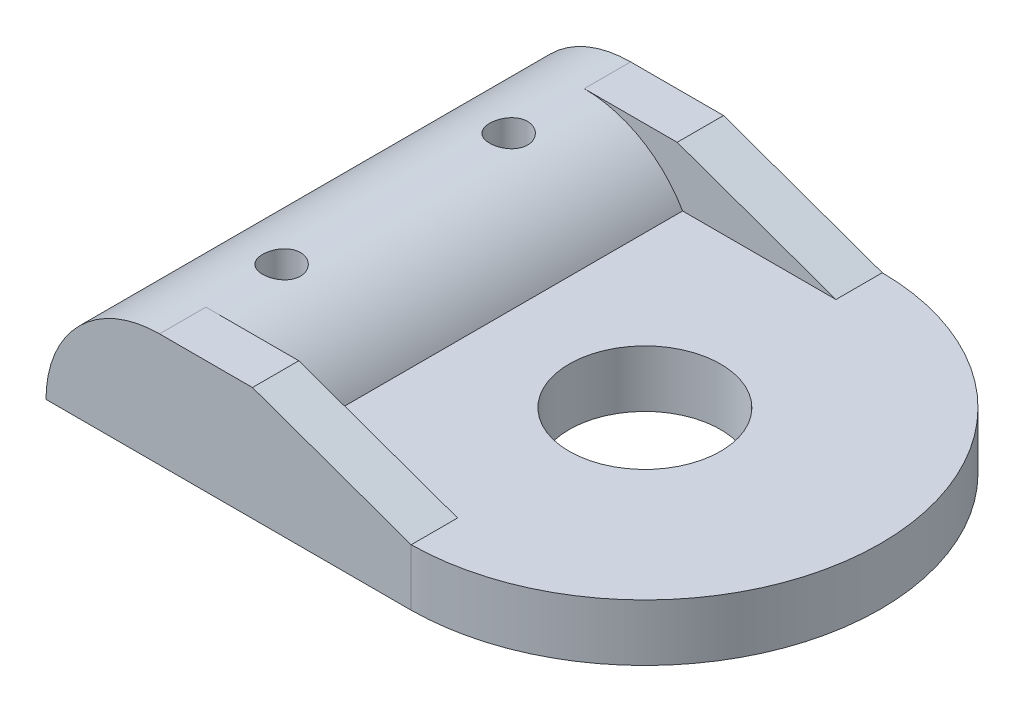
ISO-10303-21;
HEADER;
FILE_DESCRIPTION(('STEP AP214'),'2;1');
FILE_NAME('part.step','',(''),(''),'','','');
FILE_SCHEMA(('AUTOMOTIVE_DESIGN { 1 0 10303 214 1 1 1 1 }'));
ENDSEC;
DATA;
#1=APPLICATION_CONTEXT('core data for automotive mechanical design processes');
#2=APPLICATION_PROTOCOL_DEFINITION('international standard','automotive_design',2000,#1);
#3=PRODUCT_CONTEXT('',#1,'mechanical');
#4=PRODUCT('Part','Part','',(#3));
#5=PRODUCT_RELATED_PRODUCT_CATEGORY('part','',(#4));
#6=PRODUCT_DEFINITION_FORMATION('','',#4);
#7=PRODUCT_DEFINITION_CONTEXT('part definition',#1,'design');
#8=PRODUCT_DEFINITION('design','',#6,#7);
#9=PRODUCT_DEFINITION_SHAPE('','',#8);
#10=(LENGTH_UNIT() NAMED_UNIT(*) SI_UNIT(.MILLI.,.METRE.));
#11=(NAMED_UNIT(*) PLANE_ANGLE_UNIT() SI_UNIT($,.RADIAN.));
#12=(NAMED_UNIT(*) SI_UNIT($,.STERADIAN.) SOLID_ANGLE_UNIT());
#13=UNCERTAINTY_MEASURE_WITH_UNIT(LENGTH_MEASURE(1.E-05),#10,'distance_accuracy_value','');
#14=(GEOMETRIC_REPRESENTATION_CONTEXT(3) GLOBAL_UNCERTAINTY_ASSIGNED_CONTEXT((#13)) GLOBAL_UNIT_ASSIGNED_CONTEXT((#10,
#11,#12)) REPRESENTATION_CONTEXT('',''));
#15=CARTESIAN_POINT('',(0.,0.,0.));
#16=DIRECTION('',(0.,0.,1.));
#17=DIRECTION('',(1.,0.,0.));
#18=AXIS2_PLACEMENT_3D('',#15,#16,#17);
#19=CARTESIAN_POINT('',(4.11917536426009,3.,0.372218896237082));
#20=DIRECTION('',(0.,1.,0.));
#21=DIRECTION('',(0.,0.,1.));
#22=AXIS2_PLACEMENT_3D('',#19,#20,#21);
#23=PLANE('',#22);
#24=CARTESIAN_POINT('',(4.11917536426009,3.,0.372218896237082));
#25=DIRECTION('',(0.,1.,0.));
#26=DIRECTION('',(0.,0.,1.));
#27=AXIS2_PLACEMENT_3D('',#24,#25,#26);
#28=CIRCLE('',#27,3.99942615782216);
#29=CARTESIAN_POINT('',(4.11917536426009,3.,4.37164505405924));
#30=VERTEX_POINT('',#29);
#31=EDGE_CURVE('E165',#30,#30,#28,.T.);
#32=ORIENTED_EDGE('',*,*,#31,.F.);
#33=EDGE_LOOP('',(#32));
#34=FACE_BOUND('',#33,.T.);
#35=DIRECTION('',(0.,0.,-1.));
#36=VECTOR('',#35,1.);
#37=CARTESIAN_POINT('',(4.21842255479832,3.,-12.0752609670835));
#38=LINE('',#37,#36);
#39=CARTESIAN_POINT('',(4.21842255479832,3.,-9.62526096708351));
#40=VERTEX_POINT('',#39);
#41=CARTESIAN_POINT('',(4.21842255479832,3.,-12.0752609670835));
#42=VERTEX_POINT('',#41);
#43=EDGE_CURVE('E210',#40,#42,#38,.T.);
#44=ORIENTED_EDGE('',*,*,#43,.F.);
#45=DIRECTION('',(1.,0.,0.));
#46=VECTOR('',#45,1.);
#47=CARTESIAN_POINT('',(4.21842255479832,3.,-9.62526096708351));
#48=LINE('',#47,#46);
#49=CARTESIAN_POINT('',(-3.88542473638954,3.,-9.62526096708351));
#50=VERTEX_POINT('',#49);
#51=EDGE_CURVE('E209',#50,#40,#48,.T.);
#52=ORIENTED_EDGE('',*,*,#51,.F.);
#53=DIRECTION('',(0.,0.,1.));
#54=VECTOR('',#53,1.);
#55=CARTESIAN_POINT('',(-3.88542473638954,3.,-22.8919147934755));
#56=LINE('',#55,#54);
#57=CARTESIAN_POINT('',(-3.88542473638954,3.,10.3696987595577));
#58=VERTEX_POINT('',#57);
#59=EDGE_CURVE('E137',#50,#58,#56,.T.);
#60=ORIENTED_EDGE('',*,*,#59,.T.);
#61=DIRECTION('',(-1.,0.,0.));
#62=VECTOR('',#61,1.);
#63=CARTESIAN_POINT('',(4.21842255479832,3.,10.3696987595577));
#64=LINE('',#63,#62);
#65=CARTESIAN_POINT('',(4.21842255479832,3.,10.3696987595577));
#66=VERTEX_POINT('',#65);
#67=EDGE_CURVE('E146',#66,#58,#64,.T.);
#68=ORIENTED_EDGE('',*,*,#67,.F.);
#69=DIRECTION('',(0.,0.,-1.));
#70=VECTOR('',#69,1.);
#71=CARTESIAN_POINT('',(4.21842255479832,3.,12.8196987595577));
#72=LINE('',#71,#70);
#73=CARTESIAN_POINT('',(4.21842255479832,3.,12.8196987595577));
#74=VERTEX_POINT('',#73);
#75=EDGE_CURVE('E143',#74,#66,#72,.T.);
#76=ORIENTED_EDGE('',*,*,#75,.F.);
#77=CARTESIAN_POINT('',(4.11917536426009,3.,0.372218896237082));
#78=DIRECTION('',(0.,1.,0.));
#79=DIRECTION('',(0.,0.,1.));
#80=AXIS2_PLACEMENT_3D('',#77,#78,#79);
#81=CIRCLE('',#80,12.447875519646);
#82=EDGE_CURVE('E173',#74,#42,#81,.T.);
#83=ORIENTED_EDGE('',*,*,#82,.T.);
#84=EDGE_LOOP('',(#44,#52,#60,#68,#76,#83));
#85=FACE_BOUND('',#84,.T.);
#86=ADVANCED_FACE('F39',(#34,#85),#23,.T.);
#87=CARTESIAN_POINT('',(-9.08157715909618,0.,-22.8919147934755));
#88=DIRECTION('',(0.,0.,1.));
#89=DIRECTION('',(1.,0.,0.));
#90=AXIS2_PLACEMENT_3D('',#87,#88,#89);
#91=CYLINDRICAL_SURFACE('',#90,6.);
#92=CARTESIAN_POINT('',(-9.08157736726677,6.,-6.62840351469082));
#93=CARTESIAN_POINT('',(-9.13733373608122,5.9999990427406,-6.62840127911144));
#94=CARTESIAN_POINT('',(-9.19312053363991,5.9992147075897,-6.62372460412152));
#95=CARTESIAN_POINT('',(-9.30312948293314,5.99616137113838,-6.60514924832354));
#96=CARTESIAN_POINT('',(-9.35735014800049,5.99389100463113,-6.59124208736609));
#97=CARTESIAN_POINT('',(-9.4626193123622,5.98812025681556,-6.55463732626242));
#98=CARTESIAN_POINT('',(-9.5136703669585,5.98462088187845,-6.53194691671398));
#99=CARTESIAN_POINT('',(-9.6112341680315,5.97677688426047,-6.47843857974568));
#100=CARTESIAN_POINT('',(-9.6577474327377,5.97243235826851,-6.44762158189909));
#101=CARTESIAN_POINT('',(-9.74536649314108,5.96333323778109,-6.3784214509825));
#102=CARTESIAN_POINT('',(-9.78642261390057,5.95857545258506,-6.3399758339112));
#103=CARTESIAN_POINT('',(-9.8615328612073,5.94921046786042,-6.25674428206739));
#104=CARTESIAN_POINT('',(-9.89558654569421,5.94460327785425,-6.21195794730969));
#105=CARTESIAN_POINT('',(-9.95592432358438,5.93603021677279,-6.11697506558181));
#106=CARTESIAN_POINT('',(-9.98215929769411,5.93206846818264,-6.06674691106923));
#107=CARTESIAN_POINT('',(-10.0258008280066,5.92527910775825,-5.96251960701163));
#108=CARTESIAN_POINT('',(-10.043207980554,5.9224514193177,-5.90852071247131));
#109=CARTESIAN_POINT('',(-10.0685432378852,5.91828209272935,-5.79881130260128));
#110=CARTESIAN_POINT('',(-10.0765570992656,5.91692701870042,-5.74312111135401));
#111=CARTESIAN_POINT('',(-10.0831441783145,5.91581570002871,-5.6311712819635));
#112=CARTESIAN_POINT('',(-10.0817180641015,5.91605934223605,-5.57491168440165));
#113=CARTESIAN_POINT('',(-10.0695355257645,5.91810566081447,-5.46403222883277));
#114=CARTESIAN_POINT('',(-10.0588754379436,5.91989223944691,-5.4094014458394));
#115=CARTESIAN_POINT('',(-10.0286787380208,5.92479792925377,-5.30271482825528));
#116=CARTESIAN_POINT('',(-10.0091418214774,5.92791708613035,-5.25065908204645));
#117=CARTESIAN_POINT('',(-9.96164837307206,5.93515387055943,-5.15031180891748));
#118=CARTESIAN_POINT('',(-9.93365183715376,5.93927622361583,-5.10203957035188));
#119=CARTESIAN_POINT('',(-9.87006227177794,5.94805163316118,-5.01084156211466));
#120=CARTESIAN_POINT('',(-9.83446862920198,5.95270473246946,-4.96791622440345));
#121=CARTESIAN_POINT('',(-9.75617033709956,5.96208807838317,-4.88807287343402));
#122=CARTESIAN_POINT('',(-9.71338303283066,5.96681856645433,-4.85123589572029));
#123=CARTESIAN_POINT('',(-9.62219153625131,5.97577038051896,-4.78525218971124));
#124=CARTESIAN_POINT('',(-9.5737873077528,5.97999170323169,-4.75610551096604));
#125=CARTESIAN_POINT('',(-9.47265978530612,5.98745555465989,-4.70632239358313));
#126=CARTESIAN_POINT('',(-9.41993290256392,5.99069725938861,-4.68569311387927));
#127=CARTESIAN_POINT('',(-9.3116967371205,5.99583000290953,-4.65360559102985));
#128=CARTESIAN_POINT('',(-9.25618768759404,5.99772115469032,-4.64214658068079));
#129=CARTESIAN_POINT('',(-9.14466133857459,5.9999245171317,-4.62883473005876));
#130=CARTESIAN_POINT('',(-9.08865766601041,6.00025501186507,-4.62687064430186));
#131=CARTESIAN_POINT('',(-8.97712144816774,5.99934990120014,-4.63230781115083));
#132=CARTESIAN_POINT('',(-8.92158888484448,5.99811435606057,-4.63970870340726));
#133=CARTESIAN_POINT('',(-8.81291486694258,5.99422731579138,-4.66357321653672));
#134=CARTESIAN_POINT('',(-8.75976098347501,5.99158442848139,-4.67998176196736));
#135=CARTESIAN_POINT('',(-8.65695856459338,5.98517786918527,-4.72133709051649));
#136=CARTESIAN_POINT('',(-8.60731022621415,5.98141413426203,-4.74628435310729));
#137=CARTESIAN_POINT('',(-8.5124450254786,5.97313807880032,-4.80426374244933));
#138=CARTESIAN_POINT('',(-8.46727119553224,5.96861943766409,-4.83736535872793));
#139=CARTESIAN_POINT('',(-8.3830798516592,5.95935388446091,-4.91061823059262));
#140=CARTESIAN_POINT('',(-8.34406278529402,5.95460695583146,-4.95076999823655));
#141=CARTESIAN_POINT('',(-8.27288016058081,5.94536071638776,-5.03748233796851));
#142=CARTESIAN_POINT('',(-8.24078976398503,5.9408644800387,-5.08410499029549));
#143=CARTESIAN_POINT('',(-8.18489633722473,5.9326861345821,-5.18214452301921));
#144=CARTESIAN_POINT('',(-8.16109304436066,5.92900399966905,-5.23356125137917));
#145=CARTESIAN_POINT('',(-8.1225619204819,5.92289383001558,-5.33951924686048));
#146=CARTESIAN_POINT('',(-8.10779667795918,5.92046063235937,-5.39404659828208));
#147=CARTESIAN_POINT('',(-8.08764306641452,5.91711088226498,-5.50485142528434));
#148=CARTESIAN_POINT('',(-8.08225388218765,5.91619419797332,-5.56112874827995));
#149=CARTESIAN_POINT('',(-8.08102809979169,5.91598694706944,-5.67308546044099));
#150=CARTESIAN_POINT('',(-8.08507319196799,5.91667624073078,-5.72876355236291));
#151=CARTESIAN_POINT('',(-8.10234531241231,5.91955914052197,-5.83863511377483));
#152=CARTESIAN_POINT('',(-8.11557231091962,5.92175274177599,-5.89282858807622));
#153=CARTESIAN_POINT('',(-8.15078745738631,5.92738943991369,-5.99814680936672));
#154=CARTESIAN_POINT('',(-8.1727654194716,5.93083108369689,-6.04927504487816));
#155=CARTESIAN_POINT('',(-8.22484646017482,5.9385774905101,-6.14713772084181));
#156=CARTESIAN_POINT('',(-8.25494994178369,5.94288229634654,-6.19387194321477));
#157=CARTESIAN_POINT('',(-8.32284971957088,5.95193383076611,-6.28221770343301));
#158=CARTESIAN_POINT('',(-8.36073305237636,5.95668519670549,-6.32376188209327));
#159=CARTESIAN_POINT('',(-8.44293367508654,5.96605750323686,-6.39994412682161));
#160=CARTESIAN_POINT('',(-8.4872524478043,5.9706784134762,-6.43458059688215));
#161=CARTESIAN_POINT('',(-8.58142963633742,5.97930613074916,-6.49618280445517));
#162=CARTESIAN_POINT('',(-8.63132419506096,5.98330847642638,-6.52309391627335));
#163=CARTESIAN_POINT('',(-8.73497209455947,5.99020467990322,-6.56811130010541));
#164=CARTESIAN_POINT('',(-8.78872153073509,5.99309964105489,-6.58622634103439));
#165=CARTESIAN_POINT('',(-8.88249601638448,5.99682316938469,-6.60920562147432));
#166=CARTESIAN_POINT('',(-8.92195381361409,5.99800811409579,-6.6163933007455));
#167=CARTESIAN_POINT('',(-9.00146163234133,5.99959686661552,-6.62599300947068));
#168=CARTESIAN_POINT('',(-9.04151164363081,6.00000068787281,-6.62840512114596));
#169=CARTESIAN_POINT('',(-9.08157736726677,6.,-6.62840351469082));
#170=B_SPLINE_CURVE_WITH_KNOTS('',3,(#92,#93,#94,#95,#96,#97,#98,#99,#100,#101,#102,#103,#104,
#105,#106,#107,#108,#109,#110,#111,#112,#113,#114,#115,#116,#117,#118,#119,#120,#121,#122,#123,
#124,#125,#126,#127,#128,#129,#130,#131,#132,#133,#134,#135,#136,#137,#138,#139,#140,#141,#142,
#143,#144,#145,#146,#147,#148,#149,#150,#151,#152,#153,#154,#155,#156,#157,#158,#159,#160,#161,
#162,#163,#164,#165,#166,#167,#168,#169),.UNSPECIFIED.,.T.,.F.,(4,2,2,2,2,2,2,2,2,2,2,2,2,2,2,2,
2,2,2,2,2,2,2,2,2,2,2,2,2,2,2,2,2,2,2,2,2,2,4),(0.,0.167122654448334,0.334399059242411,
0.501538808208842,0.668659446905194,0.837210067389465,1.00577132512634,1.17537022910613,
1.34495767466871,1.51298449543574,1.68099942415514,1.84728231251463,2.01357090417887,
2.18065848977293,2.34775956513982,2.51693138287494,2.68610429059076,2.8554191012779,
3.02471974525996,3.1920319218123,3.35933766065431,3.52563165599521,3.691934990731,3.85970776917,
4.02749273811751,4.1970157938139,4.36653347517349,4.53534463549733,4.70414111773744,
4.87083222520226,5.03752279238489,5.20401990100976,5.37052526869543,5.53900620579525,
5.70752602498027,5.8772096359117,6.04672373800653,6.16681773830443,6.28690967091786),.UNSPECIFIED.);
#171=CARTESIAN_POINT('',(-9.08157736726677,6.,-6.62840351469082));
#172=VERTEX_POINT('',#171);
#173=EDGE_CURVE('E248',#172,#172,#170,.T.);
#174=ORIENTED_EDGE('',*,*,#173,.F.);
#175=EDGE_LOOP('',(#174));
#176=FACE_BOUND('',#175,.T.);
#177=CARTESIAN_POINT('',(-9.08157658468094,5.99999999999997,5.3715961947882));
#178=CARTESIAN_POINT('',(-9.13733297233239,5.99999905001255,5.37159843036785));
#179=CARTESIAN_POINT('',(-9.19311978882885,5.99921472160821,5.37627510685072));
#180=CARTESIAN_POINT('',(-9.30312877565598,5.99616139744235,5.39485046866601));
#181=CARTESIAN_POINT('',(-9.35734945931987,5.99389103647353,5.40875763414646));
#182=CARTESIAN_POINT('',(-9.46261865997638,5.98812029848601,5.44536240724483));
#183=CARTESIAN_POINT('',(-9.51366973227048,5.98462092783906,5.46805282426587));
#184=CARTESIAN_POINT('',(-9.61123356730954,5.97677693763232,5.5215611789201));
#185=CARTESIAN_POINT('',(-9.65774684828365,5.97243241476147,5.55237818698059));
#186=CARTESIAN_POINT('',(-9.74536593936962,5.96333329953383,5.62157834077953));
#187=CARTESIAN_POINT('',(-9.78642207454079,5.95857551646859,5.66002397052358));
#188=CARTESIAN_POINT('',(-9.86153234841903,5.94921053517089,5.74325554979039));
#189=CARTESIAN_POINT('',(-9.89558604506536,5.94460334646082,5.78804189929871));
#190=CARTESIAN_POINT('',(-9.95592384518079,5.93603028729647,5.88302481288563));
#191=CARTESIAN_POINT('',(-9.98215882924281,5.93206853933167,5.93325298458005));
#192=CARTESIAN_POINT('',(-10.0258003764688,5.92527917974416,6.0374803243586));
#193=CARTESIAN_POINT('',(-10.0432075359767,5.92245149151527,6.09147923743829));
#194=CARTESIAN_POINT('',(-10.068542804206,5.91828216506399,6.20118868586709));
#195=CARTESIAN_POINT('',(-10.0765566694207,5.91692709098351,6.25687889715708));
#196=CARTESIAN_POINT('',(-10.0831437526753,5.91581577209203,6.36882876698738));
#197=CARTESIAN_POINT('',(-10.0817176388336,5.91605941413123,6.4250883849463));
#198=CARTESIAN_POINT('',(-10.0695350977381,5.91810573226979,6.53596788121998));
#199=CARTESIAN_POINT('',(-10.0588750067668,5.91989231064104,6.59059868451695));
#200=CARTESIAN_POINT('',(-10.0286782971003,5.92479799974873,6.6972853419014));
#201=CARTESIAN_POINT('',(-10.0091413739633,5.92791715618732,6.74934110760693));
#202=CARTESIAN_POINT('',(-9.96164790913384,5.935153939385,6.84968841828107));
#203=CARTESIAN_POINT('',(-9.93365136339652,5.9392762916431,6.89796067490171));
#204=CARTESIAN_POINT('',(-9.8700617753863,5.94805169902327,6.98915871735049));
#205=CARTESIAN_POINT('',(-9.83446811999507,5.95270479696459,7.03208407121831));
#206=CARTESIAN_POINT('',(-9.75616979987444,5.96208813925867,7.1119274518468));
#207=CARTESIAN_POINT('',(-9.71338248044372,5.9668186250668,7.14876444310565));
#208=CARTESIAN_POINT('',(-9.62219095142212,5.9757704335485,7.21474817345299));
#209=CARTESIAN_POINT('',(-9.57378670564376,5.97999175294135,7.24389486299215));
#210=CARTESIAN_POINT('',(-9.47265914775692,5.9874555964468,7.29367799852123));
#211=CARTESIAN_POINT('',(-9.41993224691304,5.99069729658537,7.31430728569429));
#212=CARTESIAN_POINT('',(-9.31169604437744,5.99583002966188,7.3463948204096));
#213=CARTESIAN_POINT('',(-9.25618697586068,5.99772117558859,7.35785383515606));
#214=CARTESIAN_POINT('',(-9.14466058903947,5.9999245251837,7.37116569136986));
#215=CARTESIAN_POINT('',(-9.08865689767237,6.00025501294583,7.37312977839949));
#216=CARTESIAN_POINT('',(-8.97712064246112,5.99934988734611,7.36769261117558));
#217=CARTESIAN_POINT('',(-8.92158806057223,5.99811433424288,7.36029171727086));
#218=CARTESIAN_POINT('',(-8.8129140055784,5.99422727735807,7.33642719792459));
#219=CARTESIAN_POINT('',(-8.75976010360858,5.99158438138093,7.32001864781743));
#220=CARTESIAN_POINT('',(-8.65695764884541,5.98517780437647,7.27866330712663));
#221=CARTESIAN_POINT('',(-8.60730929308741,5.98141406041188,7.25371603706939));
#222=CARTESIAN_POINT('',(-8.51244405785902,5.97313798675231,7.19573662949714));
#223=CARTESIAN_POINT('',(-8.46727021091906,5.96861933644426,7.16263500225809));
#224=CARTESIAN_POINT('',(-8.38307883513181,5.95935376543327,7.08938210575698));
#225=CARTESIAN_POINT('',(-8.34406175384668,5.95460682816785,7.04923032443629));
#226=CARTESIAN_POINT('',(-8.27287910133201,5.94536057239852,6.96251795443819));
#227=CARTESIAN_POINT('',(-8.24078869193604,5.94086432837319,6.91589528545045));
#228=CARTESIAN_POINT('',(-8.18489524261753,5.9326859691985,6.81785571724448));
#229=CARTESIAN_POINT('',(-8.16109193999431,5.92900382824347,6.76643897006368));
#230=CARTESIAN_POINT('',(-8.12256080044201,5.92289364868983,6.66048093643553));
#231=CARTESIAN_POINT('',(-8.10779555181642,5.92046044714262,6.60595356575945));
#232=CARTESIAN_POINT('',(-8.08764193140258,5.91711069161835,6.49514869937098));
#233=CARTESIAN_POINT('',(-8.08225274440723,5.9161940057873,6.43887135624408));
#234=CARTESIAN_POINT('',(-8.08102695996288,5.91598675429428,6.32691460545372));
#235=CARTESIAN_POINT('',(-8.08507205255502,5.91667604883061,6.27123649503886));
#236=CARTESIAN_POINT('',(-8.10234417664117,5.91955895264215,6.16136489701214));
#237=CARTESIAN_POINT('',(-8.11557117837423,5.92175255704151,6.10717140458882));
#238=CARTESIAN_POINT('',(-8.15078633388022,5.9273892635023,6.00185314810113));
#239=CARTESIAN_POINT('',(-8.17276430174747,5.93083091245682,5.95072489550367));
#240=CARTESIAN_POINT('',(-8.22484535638746,5.93857733130613,5.85286218654973));
#241=CARTESIAN_POINT('',(-8.25494884615241,5.94288214400753,5.80612794827319));
#242=CARTESIAN_POINT('',(-8.32284864337415,5.95193369364123,5.71778215640254));
#243=CARTESIAN_POINT('',(-8.36073198767004,5.95668506795499,5.67623796215472));
#244=CARTESIAN_POINT('',(-8.44293263568055,5.96605739206632,5.60005568830989));
#245=CARTESIAN_POINT('',(-8.48725142220949,5.97067831151141,5.56541920472168));
#246=CARTESIAN_POINT('',(-8.58142864170395,5.97930604768563,5.503816971585));
#247=CARTESIAN_POINT('',(-8.63132321772286,5.9833084030444,5.47690584794486));
#248=CARTESIAN_POINT('',(-8.73497115376281,5.99020462562986,5.43188844360965));
#249=CARTESIAN_POINT('',(-8.78872060918349,5.99309959620856,5.41377339399841));
#250=CARTESIAN_POINT('',(-8.88249513390895,5.99682314021435,5.39079410048573));
#251=CARTESIAN_POINT('',(-8.92195295075522,5.99800809126548,5.38360641655376));
#252=CARTESIAN_POINT('',(-9.00146080929883,5.99959685575764,5.37400670158794));
#253=CARTESIAN_POINT('',(-9.04151084078799,6.00000068264737,5.37159458833259));
#254=CARTESIAN_POINT('',(-9.08157658468094,5.99999999999997,5.3715961947882));
#255=B_SPLINE_CURVE_WITH_KNOTS('',3,(#177,#178,#179,#180,#181,#182,#183,#184,#185,#186,#187,
#188,#189,#190,#191,#192,#193,#194,#195,#196,#197,#198,#199,#200,#201,#202,#203,#204,#205,#206,
#207,#208,#209,#210,#211,#212,#213,#214,#215,#216,#217,#218,#219,#220,#221,#222,#223,#224,#225,
#226,#227,#228,#229,#230,#231,#232,#233,#234,#235,#236,#237,#238,#239,#240,#241,#242,#243,#244,
#245,#246,#247,#248,#249,#250,#251,#252,#253,#254),.UNSPECIFIED.,.T.,.F.,(4,2,2,2,2,2,2,2,2,2,2,
2,2,2,2,2,2,2,2,2,2,2,2,2,2,2,2,2,2,2,2,2,2,2,2,2,2,2,4),(0.,0.167122710888112,
0.334399172098372,0.50153897749787,0.6686596726389,0.837210349672201,1.00577166396795,
1.17537062691716,1.34495813146067,1.51298501308043,1.68100000265569,1.84728295225882,
2.01357160516857,2.18065925175656,2.34776038811393,2.51693226575142,2.68610523335264,
2.85542010160611,3.02472080314166,3.19203303582203,3.35933883080317,3.52563288424209,
3.69193627710146,3.85970911783555,4.02749414909651,4.19701726903559,4.36653501461495,
4.53534623559454,4.70414277845152,4.87083394109635,5.03752456345449,5.20402172664908,
5.37052714893028,5.53900814547336,5.70752802413462,5.87721169915303,6.04672586531099,
6.16681992631668,6.28691191963228),.UNSPECIFIED.);
#256=CARTESIAN_POINT('',(-9.08157658468094,5.99999999999997,5.3715961947882));
#257=VERTEX_POINT('',#256);
#258=EDGE_CURVE('E127',#257,#257,#255,.T.);
#259=ORIENTED_EDGE('',*,*,#258,.F.);
#260=EDGE_LOOP('',(#259));
#261=FACE_BOUND('',#260,.T.);
#262=DIRECTION('',(0.,0.,1.));
#263=VECTOR('',#262,1.);
#264=CARTESIAN_POINT('',(-9.08157715909618,6.,-12.0752609670835));
#265=LINE('',#264,#263);
#266=CARTESIAN_POINT('',(-9.08157715909618,6.,-12.0752609670835));
#267=VERTEX_POINT('',#266);
#268=CARTESIAN_POINT('',(-9.08157715909618,6.,-9.62526096708351));
#269=VERTEX_POINT('',#268);
#270=EDGE_CURVE('E219',#267,#269,#265,.T.);
#271=ORIENTED_EDGE('',*,*,#270,.F.);
#272=CARTESIAN_POINT('',(-9.08157715909618,0.,-12.0752609670835));
#273=DIRECTION('',(0.,0.,1.));
#274=DIRECTION('',(1.,0.,0.));
#275=AXIS2_PLACEMENT_3D('',#272,#273,#274);
#276=CIRCLE('',#275,6.);
#277=CARTESIAN_POINT('',(-15.0815771590962,0.,-12.0752609670835));
#278=VERTEX_POINT('',#277);
#279=EDGE_CURVE('E151',#278,#267,#276,.F.);
#280=ORIENTED_EDGE('',*,*,#279,.F.);
#281=DIRECTION('',(0.,0.,1.));
#282=VECTOR('',#281,1.);
#283=CARTESIAN_POINT('',(-15.0815771590962,0.,12.8196987595577));
#284=LINE('',#283,#282);
#285=CARTESIAN_POINT('',(-15.0815771590962,0.,12.8196987595577));
#286=VERTEX_POINT('',#285);
#287=EDGE_CURVE('E169',#278,#286,#284,.T.);
#288=ORIENTED_EDGE('',*,*,#287,.T.);
#289=CARTESIAN_POINT('',(-9.08157715909618,0.,12.8196987595577));
#290=DIRECTION('',(0.,0.,1.));
#291=DIRECTION('',(1.,0.,0.));
#292=AXIS2_PLACEMENT_3D('',#289,#290,#291);
#293=CIRCLE('',#292,6.);
#294=CARTESIAN_POINT('',(-9.08157715909617,6.,12.8196987595577));
#295=VERTEX_POINT('',#294);
#296=EDGE_CURVE('E133',#295,#286,#293,.T.);
#297=ORIENTED_EDGE('',*,*,#296,.F.);
#298=DIRECTION('',(0.,0.,1.));
#299=VECTOR('',#298,1.);
#300=CARTESIAN_POINT('',(-9.08157715909617,6.,12.8196987595577));
#301=LINE('',#300,#299);
#302=CARTESIAN_POINT('',(-9.08157715909618,6.,10.3696987595577));
#303=VERTEX_POINT('',#302);
#304=EDGE_CURVE('E131',#303,#295,#301,.T.);
#305=ORIENTED_EDGE('',*,*,#304,.F.);
#306=CARTESIAN_POINT('',(-9.08157715909618,0.,10.3696987595577));
#307=DIRECTION('',(0.,0.,1.));
#308=DIRECTION('',(1.,0.,0.));
#309=AXIS2_PLACEMENT_3D('',#306,#307,#308);
#310=CIRCLE('',#309,6.);
#311=EDGE_CURVE('E48',#303,#58,#310,.F.);
#312=ORIENTED_EDGE('',*,*,#311,.T.);
#313=ORIENTED_EDGE('',*,*,#59,.F.);
#314=CARTESIAN_POINT('',(-9.08157715909618,0.,-9.62526096708351));
#315=DIRECTION('',(0.,0.,-1.));
#316=DIRECTION('',(-1.,0.,0.));
#317=AXIS2_PLACEMENT_3D('',#314,#315,#316);
#318=CIRCLE('',#317,6.);
#319=EDGE_CURVE('E11',#50,#269,#318,.F.);
#320=ORIENTED_EDGE('',*,*,#319,.T.);
#321=EDGE_LOOP('',(#271,#280,#288,#297,#305,#312,#313,#320));
#322=FACE_BOUND('',#321,.T.);
#323=ADVANCED_FACE('F201',(#176,#261,#322),#91,.T.);
#324=CARTESIAN_POINT('',(4.11917536426009,0.,0.372218896237082));
#325=DIRECTION('',(0.,1.,0.));
#326=DIRECTION('',(0.,0.,1.));
#327=AXIS2_PLACEMENT_3D('',#324,#325,#326);
#328=PLANE('',#327);
#329=ORIENTED_EDGE('',*,*,#287,.F.);
#330=DIRECTION('',(-1.,0.,0.));
#331=VECTOR('',#330,1.);
#332=CARTESIAN_POINT('',(4.21842255479832,0.,-12.0752609670835));
#333=LINE('',#332,#331);
#334=CARTESIAN_POINT('',(4.21842255479832,0.,-12.0752609670835));
#335=VERTEX_POINT('',#334);
#336=EDGE_CURVE('E178',#335,#278,#333,.T.);
#337=ORIENTED_EDGE('',*,*,#336,.F.);
#338=CARTESIAN_POINT('',(4.11917536426009,0.,0.372218896237082));
#339=DIRECTION('',(0.,1.,0.));
#340=DIRECTION('',(0.,0.,1.));
#341=AXIS2_PLACEMENT_3D('',#338,#339,#340);
#342=CIRCLE('',#341,12.447875519646);
#343=CARTESIAN_POINT('',(4.21842255479832,0.,12.8196987595577));
#344=VERTEX_POINT('',#343);
#345=EDGE_CURVE('E185',#344,#335,#342,.T.);
#346=ORIENTED_EDGE('',*,*,#345,.F.);
#347=DIRECTION('',(1.,0.,0.));
#348=VECTOR('',#347,1.);
#349=CARTESIAN_POINT('',(4.21842255479832,0.,12.8196987595577));
#350=LINE('',#349,#348);
#351=EDGE_CURVE('E182',#286,#344,#350,.T.);
#352=ORIENTED_EDGE('',*,*,#351,.F.);
#353=EDGE_LOOP('',(#329,#337,#346,#352));
#354=FACE_BOUND('',#353,.T.);
#355=CARTESIAN_POINT('',(4.11917536426009,0.,0.372218896237082));
#356=DIRECTION('',(0.,1.,0.));
#357=DIRECTION('',(0.,0.,1.));
#358=AXIS2_PLACEMENT_3D('',#355,#356,#357);
#359=CIRCLE('',#358,3.99942615782216);
#360=CARTESIAN_POINT('',(4.11917536426009,0.,4.37164505405924));
#361=VERTEX_POINT('',#360);
#362=EDGE_CURVE('E164',#361,#361,#359,.T.);
#363=ORIENTED_EDGE('',*,*,#362,.T.);
#364=EDGE_LOOP('',(#363));
#365=FACE_BOUND('',#364,.T.);
#366=CARTESIAN_POINT('',(-9.08157736726677,0.,-5.62840339394417));
#367=DIRECTION('',(0.,1.,0.));
#368=DIRECTION('',(0.,0.,1.));
#369=AXIS2_PLACEMENT_3D('',#366,#367,#368);
#370=CIRCLE('',#369,1.00000012074665);
#371=CARTESIAN_POINT('',(-9.08157736726677,0.,-4.62840327319752));
#372=VERTEX_POINT('',#371);
#373=EDGE_CURVE('E160',#372,#372,#370,.T.);
#374=ORIENTED_EDGE('',*,*,#373,.T.);
#375=EDGE_LOOP('',(#374));
#376=FACE_BOUND('',#375,.T.);
#377=CARTESIAN_POINT('',(-9.08157658468094,0.,6.37159667194882));
#378=DIRECTION('',(0.,1.,0.));
#379=DIRECTION('',(0.,0.,1.));
#380=AXIS2_PLACEMENT_3D('',#377,#378,#379);
#381=CIRCLE('',#380,1.00000047716062);
#382=CARTESIAN_POINT('',(-9.08157658468094,0.,7.37159714910943));
#383=VERTEX_POINT('',#382);
#384=EDGE_CURVE('E153',#383,#383,#381,.T.);
#385=ORIENTED_EDGE('',*,*,#384,.T.);
#386=EDGE_LOOP('',(#385));
#387=FACE_BOUND('',#386,.T.);
#388=ADVANCED_FACE('F282',(#354,#365,#376,#387),#328,.F.);
#389=CARTESIAN_POINT('',(4.21842255479832,3.,12.8196987595577));
#390=DIRECTION('',(0.,0.,-1.));
#391=DIRECTION('',(-1.,0.,0.));
#392=AXIS2_PLACEMENT_3D('',#389,#390,#391);
#393=PLANE('',#392);
#394=DIRECTION('',(0.,-1.,0.));
#395=VECTOR('',#394,1.);
#396=CARTESIAN_POINT('',(4.21842255479832,3.,12.8196987595577));
#397=LINE('',#396,#395);
#398=EDGE_CURVE('E124',#74,#344,#397,.T.);
#399=ORIENTED_EDGE('',*,*,#398,.F.);
#400=DIRECTION('',(0.941614886789678,-0.336691854632781,0.));
#401=VECTOR('',#400,1.);
#402=CARTESIAN_POINT('',(-4.17157744520168,6.,12.8196987595577));
#403=LINE('',#402,#401);
#404=CARTESIAN_POINT('',(-4.17157744520168,6.,12.8196987595577));
#405=VERTEX_POINT('',#404);
#406=EDGE_CURVE('E110',#405,#74,#403,.T.);
#407=ORIENTED_EDGE('',*,*,#406,.F.);
#408=DIRECTION('',(1.,0.,0.));
#409=VECTOR('',#408,1.);
#410=CARTESIAN_POINT('',(4.21842255479832,6.,12.8196987595577));
#411=LINE('',#410,#409);
#412=EDGE_CURVE('E121',#295,#405,#411,.T.);
#413=ORIENTED_EDGE('',*,*,#412,.F.);
#414=ORIENTED_EDGE('',*,*,#296,.T.);
#415=ORIENTED_EDGE('',*,*,#351,.T.);
#416=EDGE_LOOP('',(#399,#407,#413,#414,#415));
#417=FACE_BOUND('',#416,.T.);
#418=ADVANCED_FACE('F41',(#417),#393,.F.);
#419=CARTESIAN_POINT('',(4.11917536426009,3.,0.372218896237082));
#420=DIRECTION('',(0.,-1.,0.));
#421=DIRECTION('',(0.,0.,-1.));
#422=AXIS2_PLACEMENT_3D('',#419,#420,#421);
#423=CYLINDRICAL_SURFACE('',#422,12.447875519646);
#424=ORIENTED_EDGE('',*,*,#345,.T.);
#425=DIRECTION('',(0.,-1.,0.));
#426=VECTOR('',#425,1.);
#427=CARTESIAN_POINT('',(4.21842255479832,3.,-12.0752609670835));
#428=LINE('',#427,#426);
#429=EDGE_CURVE('E177',#42,#335,#428,.T.);
#430=ORIENTED_EDGE('',*,*,#429,.F.);
#431=ORIENTED_EDGE('',*,*,#82,.F.);
#432=ORIENTED_EDGE('',*,*,#398,.T.);
#433=EDGE_LOOP('',(#424,#430,#431,#432));
#434=FACE_BOUND('',#433,.T.);
#435=ADVANCED_FACE('F294',(#434),#423,.T.);
#436=CARTESIAN_POINT('',(4.21842255479832,3.,-12.0752609670835));
#437=DIRECTION('',(0.,0.,1.));
#438=DIRECTION('',(1.,0.,0.));
#439=AXIS2_PLACEMENT_3D('',#436,#437,#438);
#440=PLANE('',#439);
#441=DIRECTION('',(-1.,0.,0.));
#442=VECTOR('',#441,1.);
#443=CARTESIAN_POINT('',(4.21842255479832,6.,-12.0752609670835));
#444=LINE('',#443,#442);
#445=CARTESIAN_POINT('',(-4.17157744520168,6.,-12.0752609670835));
#446=VERTEX_POINT('',#445);
#447=EDGE_CURVE('E214',#446,#267,#444,.T.);
#448=ORIENTED_EDGE('',*,*,#447,.F.);
#449=DIRECTION('',(-0.941614886789678,0.336691854632781,0.));
#450=VECTOR('',#449,1.);
#451=CARTESIAN_POINT('',(-4.17157744520168,6.,-12.0752609670835));
#452=LINE('',#451,#450);
#453=EDGE_CURVE('E63',#42,#446,#452,.T.);
#454=ORIENTED_EDGE('',*,*,#453,.F.);
#455=ORIENTED_EDGE('',*,*,#429,.T.);
#456=ORIENTED_EDGE('',*,*,#336,.T.);
#457=ORIENTED_EDGE('',*,*,#279,.T.);
#458=EDGE_LOOP('',(#448,#454,#455,#456,#457));
#459=FACE_BOUND('',#458,.T.);
#460=ADVANCED_FACE('F292',(#459),#440,.F.);
#461=CARTESIAN_POINT('',(4.11917536426009,3.,0.372218896237082));
#462=DIRECTION('',(0.,-1.,0.));
#463=DIRECTION('',(0.,0.,-1.));
#464=AXIS2_PLACEMENT_3D('',#461,#462,#463);
#465=CYLINDRICAL_SURFACE('',#464,3.99942615782216);
#466=ORIENTED_EDGE('',*,*,#31,.T.);
#467=EDGE_LOOP('',(#466));
#468=FACE_BOUND('',#467,.T.);
#469=ORIENTED_EDGE('',*,*,#362,.F.);
#470=EDGE_LOOP('',(#469));
#471=FACE_BOUND('',#470,.T.);
#472=ADVANCED_FACE('F287',(#468,#471),#465,.F.);
#473=CARTESIAN_POINT('',(-9.08157736726677,3.,-5.62840339394417));
#474=DIRECTION('',(0.,-1.,0.));
#475=DIRECTION('',(0.,0.,-1.));
#476=AXIS2_PLACEMENT_3D('',#473,#474,#475);
#477=CYLINDRICAL_SURFACE('',#476,1.00000012074665);
#478=ORIENTED_EDGE('',*,*,#373,.F.);
#479=EDGE_LOOP('',(#478));
#480=FACE_BOUND('',#479,.T.);
#481=ORIENTED_EDGE('',*,*,#173,.T.);
#482=EDGE_LOOP('',(#481));
#483=FACE_BOUND('',#482,.T.);
#484=ADVANCED_FACE('F274',(#480,#483),#477,.F.);
#485=CARTESIAN_POINT('',(-9.08157658468094,3.,6.37159667194882));
#486=DIRECTION('',(0.,-1.,0.));
#487=DIRECTION('',(0.,0.,-1.));
#488=AXIS2_PLACEMENT_3D('',#485,#486,#487);
#489=CYLINDRICAL_SURFACE('',#488,1.00000047716062);
#490=ORIENTED_EDGE('',*,*,#384,.F.);
#491=EDGE_LOOP('',(#490));
#492=FACE_BOUND('',#491,.T.);
#493=ORIENTED_EDGE('',*,*,#258,.T.);
#494=EDGE_LOOP('',(#493));
#495=FACE_BOUND('',#494,.T.);
#496=ADVANCED_FACE('F270',(#492,#495),#489,.F.);
#497=CARTESIAN_POINT('',(4.21842255479832,6.,10.3696987595577));
#498=DIRECTION('',(0.,0.,1.));
#499=DIRECTION('',(1.,0.,0.));
#500=AXIS2_PLACEMENT_3D('',#497,#498,#499);
#501=PLANE('',#500);
#502=DIRECTION('',(-1.,0.,0.));
#503=VECTOR('',#502,1.);
#504=CARTESIAN_POINT('',(4.21842255479832,6.,10.3696987595577));
#505=LINE('',#504,#503);
#506=CARTESIAN_POINT('',(-4.17157744520168,6.,10.3696987595577));
#507=VERTEX_POINT('',#506);
#508=EDGE_CURVE('E139',#507,#303,#505,.T.);
#509=ORIENTED_EDGE('',*,*,#508,.F.);
#510=DIRECTION('',(0.941614886789678,-0.336691854632781,0.));
#511=VECTOR('',#510,1.);
#512=CARTESIAN_POINT('',(3.26732036704916,3.34008421492819,10.3696987595577));
#513=LINE('',#512,#511);
#514=EDGE_CURVE('E55',#507,#66,#513,.T.);
#515=ORIENTED_EDGE('',*,*,#514,.T.);
#516=ORIENTED_EDGE('',*,*,#67,.T.);
#517=ORIENTED_EDGE('',*,*,#311,.F.);
#518=EDGE_LOOP('',(#509,#515,#516,#517));
#519=FACE_BOUND('',#518,.T.);
#520=ADVANCED_FACE('F204',(#519),#501,.F.);
#521=CARTESIAN_POINT('',(0.,6.,0.));
#522=DIRECTION('',(0.,1.,0.));
#523=DIRECTION('',(0.,0.,1.));
#524=AXIS2_PLACEMENT_3D('',#521,#522,#523);
#525=PLANE('',#524);
#526=DIRECTION('',(0.,0.,1.));
#527=VECTOR('',#526,1.);
#528=CARTESIAN_POINT('',(-4.17157744520168,6.,-21.786655941858));
#529=LINE('',#528,#527);
#530=EDGE_CURVE('E107',#507,#405,#529,.T.);
#531=ORIENTED_EDGE('',*,*,#530,.F.);
#532=ORIENTED_EDGE('',*,*,#508,.T.);
#533=ORIENTED_EDGE('',*,*,#304,.T.);
#534=ORIENTED_EDGE('',*,*,#412,.T.);
#535=EDGE_LOOP('',(#531,#532,#533,#534));
#536=FACE_BOUND('',#535,.T.);
#537=ADVANCED_FACE('F129',(#536),#525,.T.);
#538=CARTESIAN_POINT('',(4.21842255479832,6.,-9.62526096708351));
#539=DIRECTION('',(0.,0.,-1.));
#540=DIRECTION('',(-1.,0.,0.));
#541=AXIS2_PLACEMENT_3D('',#538,#539,#540);
#542=PLANE('',#541);
#543=ORIENTED_EDGE('',*,*,#51,.T.);
#544=DIRECTION('',(-0.941614886789678,0.336691854632781,0.));
#545=VECTOR('',#544,1.);
#546=CARTESIAN_POINT('',(3.26732036704916,3.34008421492819,-9.62526096708351));
#547=LINE('',#546,#545);
#548=CARTESIAN_POINT('',(-4.17157744520168,6.,-9.62526096708351));
#549=VERTEX_POINT('',#548);
#550=EDGE_CURVE('E234',#40,#549,#547,.T.);
#551=ORIENTED_EDGE('',*,*,#550,.T.);
#552=DIRECTION('',(1.,0.,0.));
#553=VECTOR('',#552,1.);
#554=CARTESIAN_POINT('',(4.21842255479832,6.,-9.62526096708351));
#555=LINE('',#554,#553);
#556=EDGE_CURVE('E147',#269,#549,#555,.T.);
#557=ORIENTED_EDGE('',*,*,#556,.F.);
#558=ORIENTED_EDGE('',*,*,#319,.F.);
#559=EDGE_LOOP('',(#543,#551,#557,#558));
#560=FACE_BOUND('',#559,.T.);
#561=ADVANCED_FACE('F265',(#560),#542,.F.);
#562=CARTESIAN_POINT('',(0.,6.,0.));
#563=DIRECTION('',(0.,-1.,0.));
#564=DIRECTION('',(0.,0.,-1.));
#565=AXIS2_PLACEMENT_3D('',#562,#563,#564);
#566=PLANE('',#565);
#567=ORIENTED_EDGE('',*,*,#556,.T.);
#568=EDGE_CURVE('E116',#446,#549,#529,.T.);
#569=ORIENTED_EDGE('',*,*,#568,.F.);
#570=ORIENTED_EDGE('',*,*,#447,.T.);
#571=ORIENTED_EDGE('',*,*,#270,.T.);
#572=EDGE_LOOP('',(#567,#569,#570,#571));
#573=FACE_BOUND('',#572,.T.);
#574=ADVANCED_FACE('F262',(#573),#566,.F.);
#575=CARTESIAN_POINT('',(-4.17157744520168,6.,-21.786655941858));
#576=DIRECTION('',(-0.336691854632781,-0.941614886789678,0.));
#577=DIRECTION('',(0.941614886789678,-0.336691854632781,0.));
#578=AXIS2_PLACEMENT_3D('',#575,#576,#577);
#579=PLANE('',#578);
#580=ORIENTED_EDGE('',*,*,#43,.T.);
#581=ORIENTED_EDGE('',*,*,#453,.T.);
#582=ORIENTED_EDGE('',*,*,#568,.T.);
#583=ORIENTED_EDGE('',*,*,#550,.F.);
#584=EDGE_LOOP('',(#580,#581,#582,#583));
#585=FACE_BOUND('',#584,.T.);
#586=ADVANCED_FACE('F261',(#585),#579,.F.);
#587=ORIENTED_EDGE('',*,*,#530,.T.);
#588=ORIENTED_EDGE('',*,*,#406,.T.);
#589=ORIENTED_EDGE('',*,*,#75,.T.);
#590=ORIENTED_EDGE('',*,*,#514,.F.);
#591=EDGE_LOOP('',(#587,#588,#589,#590));
#592=FACE_BOUND('',#591,.T.);
#593=ADVANCED_FACE('F109',(#592),#579,.F.);
#594=CLOSED_SHELL('',(#86,#323,#388,#418,#435,#460,#472,#484,#496,#520,#537,#561,#574,#586,#593));
#595=MANIFOLD_SOLID_BREP('B2',#594);
#596=ADVANCED_BREP_SHAPE_REPRESENTATION('',(#18,#595),#14);
#597=SHAPE_DEFINITION_REPRESENTATION(#9,#596);
ENDSEC;
END-ISO-10303-21;
